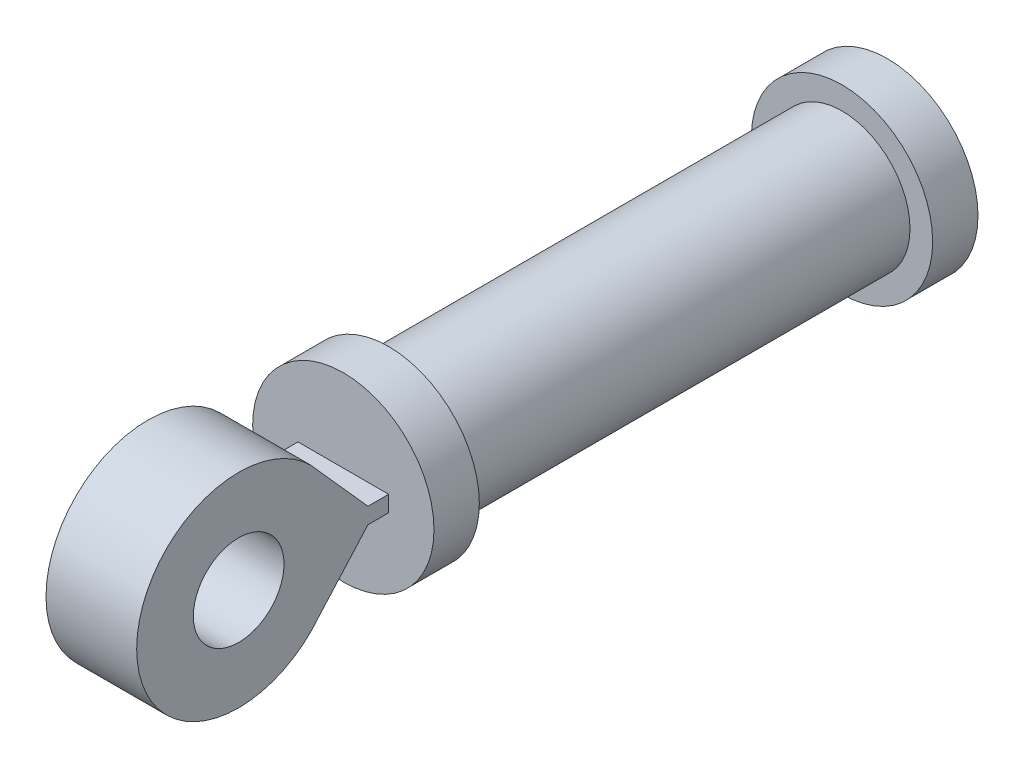
ISO-10303-21;
HEADER;
FILE_DESCRIPTION(('STEP AP214'),'2;1');
FILE_NAME('part.step','',(''),(''),'','','');
FILE_SCHEMA(('AUTOMOTIVE_DESIGN { 1 0 10303 214 1 1 1 1 }'));
ENDSEC;
DATA;
#1=APPLICATION_CONTEXT('core data for automotive mechanical design processes');
#2=APPLICATION_PROTOCOL_DEFINITION('international standard','automotive_design',2000,#1);
#3=PRODUCT_CONTEXT('',#1,'mechanical');
#4=PRODUCT('Part','Part','',(#3));
#5=PRODUCT_RELATED_PRODUCT_CATEGORY('part','',(#4));
#6=PRODUCT_DEFINITION_FORMATION('','',#4);
#7=PRODUCT_DEFINITION_CONTEXT('part definition',#1,'design');
#8=PRODUCT_DEFINITION('design','',#6,#7);
#9=PRODUCT_DEFINITION_SHAPE('','',#8);
#10=(LENGTH_UNIT() NAMED_UNIT(*) SI_UNIT(.MILLI.,.METRE.));
#11=(NAMED_UNIT(*) PLANE_ANGLE_UNIT() SI_UNIT($,.RADIAN.));
#12=(NAMED_UNIT(*) SI_UNIT($,.STERADIAN.) SOLID_ANGLE_UNIT());
#13=UNCERTAINTY_MEASURE_WITH_UNIT(LENGTH_MEASURE(1.E-05),#10,'distance_accuracy_value','');
#14=(GEOMETRIC_REPRESENTATION_CONTEXT(3) GLOBAL_UNCERTAINTY_ASSIGNED_CONTEXT((#13)) GLOBAL_UNIT_ASSIGNED_CONTEXT((#10,
#11,#12)) REPRESENTATION_CONTEXT('',''));
#15=CARTESIAN_POINT('',(0.,0.,0.));
#16=DIRECTION('',(0.,0.,1.));
#17=DIRECTION('',(1.,0.,0.));
#18=AXIS2_PLACEMENT_3D('',#15,#16,#17);
#19=CARTESIAN_POINT('',(0.,0.,-83.9277892779569));
#20=DIRECTION('',(0.,0.,-1.));
#21=DIRECTION('',(-1.,0.,0.));
#22=AXIS2_PLACEMENT_3D('',#19,#20,#21);
#23=CYLINDRICAL_SURFACE('',#22,20.);
#24=CARTESIAN_POINT('',(0.,0.,-83.9277892779569));
#25=DIRECTION('',(0.,0.,1.));
#26=DIRECTION('',(1.,0.,0.));
#27=AXIS2_PLACEMENT_3D('',#24,#25,#26);
#28=CIRCLE('',#27,20.);
#29=CARTESIAN_POINT('',(20.,0.,-83.9277892779569));
#30=VERTEX_POINT('',#29);
#31=EDGE_CURVE('E78',#30,#30,#28,.T.);
#32=ORIENTED_EDGE('',*,*,#31,.F.);
#33=EDGE_LOOP('',(#32));
#34=FACE_BOUND('',#33,.T.);
#35=CARTESIAN_POINT('',(0.,0.,-93.9277892779569));
#36=DIRECTION('',(0.,0.,1.));
#37=DIRECTION('',(1.,0.,0.));
#38=AXIS2_PLACEMENT_3D('',#35,#36,#37);
#39=CIRCLE('',#38,20.);
#40=CARTESIAN_POINT('',(20.,0.,-93.9277892779569));
#41=VERTEX_POINT('',#40);
#42=EDGE_CURVE('E190',#41,#41,#39,.T.);
#43=ORIENTED_EDGE('',*,*,#42,.T.);
#44=EDGE_LOOP('',(#43));
#45=FACE_BOUND('',#44,.T.);
#46=ADVANCED_FACE('F70',(#34,#45),#23,.T.);
#47=CARTESIAN_POINT('',(0.,0.,-83.9277892779569));
#48=DIRECTION('',(0.,0.,1.));
#49=DIRECTION('',(1.,0.,0.));
#50=AXIS2_PLACEMENT_3D('',#47,#48,#49);
#51=PLANE('',#50);
#52=CARTESIAN_POINT('',(0.,0.,-83.9277892779569));
#53=DIRECTION('',(0.,0.,1.));
#54=DIRECTION('',(1.,0.,0.));
#55=AXIS2_PLACEMENT_3D('',#52,#53,#54);
#56=CIRCLE('',#55,15.);
#57=CARTESIAN_POINT('',(15.,0.,-83.9277892779569));
#58=VERTEX_POINT('',#57);
#59=EDGE_CURVE('E12',#58,#58,#56,.T.);
#60=ORIENTED_EDGE('',*,*,#59,.F.);
#61=EDGE_LOOP('',(#60));
#62=FACE_BOUND('',#61,.T.);
#63=ORIENTED_EDGE('',*,*,#31,.T.);
#64=EDGE_LOOP('',(#63));
#65=FACE_BOUND('',#64,.T.);
#66=ADVANCED_FACE('F240',(#62,#65),#51,.T.);
#67=CARTESIAN_POINT('',(0.,0.,-93.9277892779569));
#68=DIRECTION('',(0.,0.,1.));
#69=DIRECTION('',(1.,0.,0.));
#70=AXIS2_PLACEMENT_3D('',#67,#68,#69);
#71=PLANE('',#70);
#72=CARTESIAN_POINT('',(0.,0.,-93.9277892779569));
#73=DIRECTION('',(0.,0.,1.));
#74=DIRECTION('',(1.,0.,0.));
#75=AXIS2_PLACEMENT_3D('',#72,#73,#74);
#76=CIRCLE('',#75,4.8);
#77=CARTESIAN_POINT('',(4.8,0.,-93.9277892779569));
#78=VERTEX_POINT('',#77);
#79=EDGE_CURVE('E187',#78,#78,#76,.T.);
#80=ORIENTED_EDGE('',*,*,#79,.T.);
#81=EDGE_LOOP('',(#80));
#82=FACE_BOUND('',#81,.T.);
#83=ORIENTED_EDGE('',*,*,#42,.F.);
#84=EDGE_LOOP('',(#83));
#85=FACE_BOUND('',#84,.T.);
#86=ADVANCED_FACE('F245',(#82,#85),#71,.F.);
#87=CARTESIAN_POINT('',(0.,0.,-83.9277892779569));
#88=DIRECTION('',(0.,0.,1.));
#89=DIRECTION('',(1.,0.,0.));
#90=AXIS2_PLACEMENT_3D('',#87,#88,#89);
#91=CYLINDRICAL_SURFACE('',#90,4.8);
#92=CARTESIAN_POINT('',(0.,0.,-89.1277892779569));
#93=DIRECTION('',(0.,0.,1.));
#94=DIRECTION('',(1.,0.,0.));
#95=AXIS2_PLACEMENT_3D('',#92,#93,#94);
#96=CIRCLE('',#95,4.8);
#97=CARTESIAN_POINT('',(4.8,0.,-89.1277892779569));
#98=VERTEX_POINT('',#97);
#99=EDGE_CURVE('E184',#98,#98,#96,.T.);
#100=ORIENTED_EDGE('',*,*,#99,.T.);
#101=EDGE_LOOP('',(#100));
#102=FACE_BOUND('',#101,.T.);
#103=ORIENTED_EDGE('',*,*,#79,.F.);
#104=EDGE_LOOP('',(#103));
#105=FACE_BOUND('',#104,.T.);
#106=ADVANCED_FACE('F253',(#102,#105),#91,.F.);
#107=CARTESIAN_POINT('',(4.8,0.,-89.1277892779569));
#108=DIRECTION('',(0.,0.,-1.));
#109=DIRECTION('',(-1.,0.,0.));
#110=AXIS2_PLACEMENT_3D('',#107,#108,#109);
#111=PLANE('',#110);
#112=ORIENTED_EDGE('',*,*,#99,.F.);
#113=EDGE_LOOP('',(#112));
#114=FACE_BOUND('',#113,.T.);
#115=CARTESIAN_POINT('',(0.,0.,-89.1277892779569));
#116=DIRECTION('',(0.,0.,1.));
#117=DIRECTION('',(1.,0.,0.));
#118=AXIS2_PLACEMENT_3D('',#115,#116,#117);
#119=CIRCLE('',#118,8.);
#120=CARTESIAN_POINT('',(8.,0.,-89.1277892779569));
#121=VERTEX_POINT('',#120);
#122=EDGE_CURVE('E181',#121,#121,#119,.T.);
#123=ORIENTED_EDGE('',*,*,#122,.T.);
#124=EDGE_LOOP('',(#123));
#125=FACE_BOUND('',#124,.T.);
#126=ADVANCED_FACE('F258',(#114,#125),#111,.F.);
#127=CARTESIAN_POINT('',(0.,0.,-83.9277892779569));
#128=DIRECTION('',(0.,0.,1.));
#129=DIRECTION('',(1.,0.,0.));
#130=AXIS2_PLACEMENT_3D('',#127,#128,#129);
#131=CYLINDRICAL_SURFACE('',#130,8.);
#132=ORIENTED_EDGE('',*,*,#122,.F.);
#133=EDGE_LOOP('',(#132));
#134=FACE_BOUND('',#133,.T.);
#135=CARTESIAN_POINT('',(0.,0.,-83.9777892779569));
#136=DIRECTION('',(0.,0.,1.));
#137=DIRECTION('',(1.,0.,0.));
#138=AXIS2_PLACEMENT_3D('',#135,#136,#137);
#139=CIRCLE('',#138,8.00000000000001);
#140=CARTESIAN_POINT('',(8.00000000000001,0.,-83.9777892779569));
#141=VERTEX_POINT('',#140);
#142=EDGE_CURVE('E178',#141,#141,#139,.T.);
#143=ORIENTED_EDGE('',*,*,#142,.T.);
#144=EDGE_LOOP('',(#143));
#145=FACE_BOUND('',#144,.T.);
#146=ADVANCED_FACE('F264',(#134,#145),#131,.F.);
#147=CARTESIAN_POINT('',(0.,0.,-83.9277892779569));
#148=DIRECTION('',(0.,0.,1.));
#149=DIRECTION('',(1.,0.,0.));
#150=AXIS2_PLACEMENT_3D('',#147,#148,#149);
#151=CONICAL_SURFACE('',#150,8.05,0.785398163397448);
#152=ORIENTED_EDGE('',*,*,#142,.F.);
#153=EDGE_LOOP('',(#152));
#154=FACE_BOUND('',#153,.T.);
#155=CARTESIAN_POINT('',(0.,0.,-83.9277892779569));
#156=DIRECTION('',(0.,0.,1.));
#157=DIRECTION('',(1.,0.,0.));
#158=AXIS2_PLACEMENT_3D('',#155,#156,#157);
#159=CIRCLE('',#158,8.05);
#160=CARTESIAN_POINT('',(8.05,0.,-83.9277892779569));
#161=VERTEX_POINT('',#160);
#162=EDGE_CURVE('E174',#161,#161,#159,.T.);
#163=ORIENTED_EDGE('',*,*,#162,.T.);
#164=EDGE_LOOP('',(#163));
#165=FACE_BOUND('',#164,.T.);
#166=ADVANCED_FACE('F268',(#154,#165),#151,.F.);
#167=CARTESIAN_POINT('',(0.,0.,16.0722107220431));
#168=DIRECTION('',(0.,0.,-1.));
#169=DIRECTION('',(-1.,0.,0.));
#170=AXIS2_PLACEMENT_3D('',#167,#168,#169);
#171=CYLINDRICAL_SURFACE('',#170,15.);
#172=CARTESIAN_POINT('',(0.,0.,16.0722107220431));
#173=DIRECTION('',(0.,0.,1.));
#174=DIRECTION('',(1.,0.,0.));
#175=AXIS2_PLACEMENT_3D('',#172,#173,#174);
#176=CIRCLE('',#175,15.);
#177=CARTESIAN_POINT('',(15.,0.,16.0722107220431));
#178=VERTEX_POINT('',#177);
#179=EDGE_CURVE('E170',#178,#178,#176,.T.);
#180=ORIENTED_EDGE('',*,*,#179,.F.);
#181=EDGE_LOOP('',(#180));
#182=FACE_BOUND('',#181,.T.);
#183=ORIENTED_EDGE('',*,*,#59,.T.);
#184=EDGE_LOOP('',(#183));
#185=FACE_BOUND('',#184,.T.);
#186=ADVANCED_FACE('F272',(#182,#185),#171,.T.);
#187=CARTESIAN_POINT('',(0.,0.,-83.9277892779569));
#188=DIRECTION('',(0.,0.,1.));
#189=DIRECTION('',(1.,0.,0.));
#190=AXIS2_PLACEMENT_3D('',#187,#188,#189);
#191=PLANE('',#190);
#192=CARTESIAN_POINT('',(0.,0.,-83.9277892779569));
#193=DIRECTION('',(0.,0.,1.));
#194=DIRECTION('',(1.,0.,0.));
#195=AXIS2_PLACEMENT_3D('',#192,#193,#194);
#196=CIRCLE('',#195,8.);
#197=CARTESIAN_POINT('',(8.,0.,-83.9277892779569));
#198=VERTEX_POINT('',#197);
#199=EDGE_CURVE('E167',#198,#198,#196,.T.);
#200=ORIENTED_EDGE('',*,*,#199,.T.);
#201=EDGE_LOOP('',(#200));
#202=FACE_BOUND('',#201,.T.);
#203=ORIENTED_EDGE('',*,*,#162,.F.);
#204=EDGE_LOOP('',(#203));
#205=FACE_BOUND('',#204,.T.);
#206=ADVANCED_FACE('F276',(#202,#205),#191,.F.);
#207=CARTESIAN_POINT('',(0.,0.,-83.9277892779569));
#208=DIRECTION('',(0.,0.,1.));
#209=DIRECTION('',(1.,0.,0.));
#210=AXIS2_PLACEMENT_3D('',#207,#208,#209);
#211=CYLINDRICAL_SURFACE('',#210,8.);
#212=ORIENTED_EDGE('',*,*,#199,.F.);
#213=EDGE_LOOP('',(#212));
#214=FACE_BOUND('',#213,.T.);
#215=CARTESIAN_POINT('',(0.,0.,16.0722107220431));
#216=DIRECTION('',(0.,0.,1.));
#217=DIRECTION('',(1.,0.,0.));
#218=AXIS2_PLACEMENT_3D('',#215,#216,#217);
#219=CIRCLE('',#218,8.);
#220=CARTESIAN_POINT('',(8.,0.,16.0722107220431));
#221=VERTEX_POINT('',#220);
#222=EDGE_CURVE('E163',#221,#221,#219,.T.);
#223=ORIENTED_EDGE('',*,*,#222,.T.);
#224=EDGE_LOOP('',(#223));
#225=FACE_BOUND('',#224,.T.);
#226=ADVANCED_FACE('F280',(#214,#225),#211,.F.);
#227=CARTESIAN_POINT('',(0.,0.,16.0722107220431));
#228=DIRECTION('',(0.,0.,1.));
#229=DIRECTION('',(1.,0.,0.));
#230=AXIS2_PLACEMENT_3D('',#227,#228,#229);
#231=PLANE('',#230);
#232=ORIENTED_EDGE('',*,*,#179,.T.);
#233=EDGE_LOOP('',(#232));
#234=FACE_BOUND('',#233,.T.);
#235=CARTESIAN_POINT('',(0.,0.,16.0722107220431));
#236=DIRECTION('',(0.,0.,1.));
#237=DIRECTION('',(1.,0.,0.));
#238=AXIS2_PLACEMENT_3D('',#235,#236,#237);
#239=CIRCLE('',#238,20.);
#240=CARTESIAN_POINT('',(20.,0.,16.0722107220431));
#241=VERTEX_POINT('',#240);
#242=EDGE_CURVE('E164',#241,#241,#239,.T.);
#243=ORIENTED_EDGE('',*,*,#242,.F.);
#244=EDGE_LOOP('',(#243));
#245=FACE_BOUND('',#244,.T.);
#246=ADVANCED_FACE('F284',(#234,#245),#231,.F.);
#247=CARTESIAN_POINT('',(0.,0.,26.0722107220431));
#248=DIRECTION('',(0.,0.,-1.));
#249=DIRECTION('',(-1.,0.,0.));
#250=AXIS2_PLACEMENT_3D('',#247,#248,#249);
#251=CYLINDRICAL_SURFACE('',#250,20.);
#252=CARTESIAN_POINT('',(0.,0.,26.0722107220431));
#253=DIRECTION('',(0.,0.,1.));
#254=DIRECTION('',(1.,0.,0.));
#255=AXIS2_PLACEMENT_3D('',#252,#253,#254);
#256=CIRCLE('',#255,20.);
#257=CARTESIAN_POINT('',(20.,0.,26.0722107220431));
#258=VERTEX_POINT('',#257);
#259=EDGE_CURVE('E160',#258,#258,#256,.T.);
#260=ORIENTED_EDGE('',*,*,#259,.F.);
#261=EDGE_LOOP('',(#260));
#262=FACE_BOUND('',#261,.T.);
#263=ORIENTED_EDGE('',*,*,#242,.T.);
#264=EDGE_LOOP('',(#263));
#265=FACE_BOUND('',#264,.T.);
#266=ADVANCED_FACE('F286',(#262,#265),#251,.T.);
#267=ORIENTED_EDGE('',*,*,#222,.F.);
#268=EDGE_LOOP('',(#267));
#269=FACE_BOUND('',#268,.T.);
#270=ADVANCED_FACE('F289',(#269),#231,.F.);
#271=CARTESIAN_POINT('',(-103.138410702895,0.,26.0722107220431));
#272=DIRECTION('',(0.,0.,-1.));
#273=DIRECTION('',(-1.,0.,0.));
#274=AXIS2_PLACEMENT_3D('',#271,#272,#273);
#275=PLANE('',#274);
#276=DIRECTION('',(0.,1.,0.));
#277=VECTOR('',#276,1.);
#278=CARTESIAN_POINT('',(-10.,-38.2333456830037,26.0722107220431));
#279=LINE('',#278,#277);
#280=CARTESIAN_POINT('',(-10.,-1.76665431699625,26.0722107220431));
#281=VERTEX_POINT('',#280);
#282=CARTESIAN_POINT('',(-10.,1.76665431699625,26.0722107220431));
#283=VERTEX_POINT('',#282);
#284=EDGE_CURVE('E142',#281,#283,#279,.T.);
#285=ORIENTED_EDGE('',*,*,#284,.T.);
#286=DIRECTION('',(1.,0.,0.));
#287=VECTOR('',#286,1.);
#288=CARTESIAN_POINT('',(-103.138410702895,1.76665431699625,26.0722107220431));
#289=LINE('',#288,#287);
#290=CARTESIAN_POINT('',(10.,1.76665431699625,26.0722107220431));
#291=VERTEX_POINT('',#290);
#292=EDGE_CURVE('E141',#283,#291,#289,.T.);
#293=ORIENTED_EDGE('',*,*,#292,.T.);
#294=DIRECTION('',(0.,1.,0.));
#295=VECTOR('',#294,1.);
#296=CARTESIAN_POINT('',(10.,-38.2333456830037,26.0722107220431));
#297=LINE('',#296,#295);
#298=CARTESIAN_POINT('',(10.,-1.76665431699625,26.0722107220431));
#299=VERTEX_POINT('',#298);
#300=EDGE_CURVE('E125',#299,#291,#297,.T.);
#301=ORIENTED_EDGE('',*,*,#300,.F.);
#302=DIRECTION('',(1.,0.,0.));
#303=VECTOR('',#302,1.);
#304=CARTESIAN_POINT('',(-103.138410702895,-1.76665431699625,26.0722107220431));
#305=LINE('',#304,#303);
#306=EDGE_CURVE('E139',#281,#299,#305,.T.);
#307=ORIENTED_EDGE('',*,*,#306,.F.);
#308=EDGE_LOOP('',(#285,#293,#301,#307));
#309=FACE_BOUND('',#308,.T.);
#310=ORIENTED_EDGE('',*,*,#259,.T.);
#311=EDGE_LOOP('',(#310));
#312=FACE_BOUND('',#311,.T.);
#313=ADVANCED_FACE('F137',(#309,#312),#275,.F.);
#314=CARTESIAN_POINT('',(-103.138410702895,0.,59.1571581742771));
#315=DIRECTION('',(1.,0.,0.));
#316=DIRECTION('',(0.,0.,-1.));
#317=AXIS2_PLACEMENT_3D('',#314,#315,#316);
#318=CYLINDRICAL_SURFACE('',#317,22.5);
#319=CARTESIAN_POINT('',(-9.99999999999999,0.,59.1571581742771));
#320=DIRECTION('',(1.,0.,0.));
#321=DIRECTION('',(0.,0.,-1.));
#322=AXIS2_PLACEMENT_3D('',#319,#320,#321);
#323=CIRCLE('',#322,22.5);
#324=CARTESIAN_POINT('',(-9.99999999999999,-13.8371118858347,41.4149955479541));
#325=VERTEX_POINT('',#324);
#326=CARTESIAN_POINT('',(-9.99999999999999,13.8371118858347,41.4149955479541));
#327=VERTEX_POINT('',#326);
#328=EDGE_CURVE('E86',#325,#327,#323,.F.);
#329=ORIENTED_EDGE('',*,*,#328,.F.);
#330=DIRECTION('',(1.,0.,0.));
#331=VECTOR('',#330,1.);
#332=CARTESIAN_POINT('',(-103.138410702895,-13.8371118858347,41.4149955479541));
#333=LINE('',#332,#331);
#334=CARTESIAN_POINT('',(9.99999999999999,-13.8371118858347,41.4149955479541));
#335=VERTEX_POINT('',#334);
#336=EDGE_CURVE('E149',#325,#335,#333,.T.);
#337=ORIENTED_EDGE('',*,*,#336,.T.);
#338=CARTESIAN_POINT('',(9.99999999999999,0.,59.1571581742771));
#339=DIRECTION('',(-1.,0.,0.));
#340=DIRECTION('',(0.,0.,1.));
#341=AXIS2_PLACEMENT_3D('',#338,#339,#340);
#342=CIRCLE('',#341,22.5);
#343=CARTESIAN_POINT('',(9.99999999999999,13.8371118858347,41.4149955479541));
#344=VERTEX_POINT('',#343);
#345=EDGE_CURVE('E203',#344,#335,#342,.F.);
#346=ORIENTED_EDGE('',*,*,#345,.F.);
#347=DIRECTION('',(1.,0.,0.));
#348=VECTOR('',#347,1.);
#349=CARTESIAN_POINT('',(-103.138410702895,13.8371118858347,41.4149955479541));
#350=LINE('',#349,#348);
#351=EDGE_CURVE('E157',#327,#344,#350,.T.);
#352=ORIENTED_EDGE('',*,*,#351,.F.);
#353=EDGE_LOOP('',(#329,#337,#346,#352));
#354=FACE_BOUND('',#353,.T.);
#355=ADVANCED_FACE('F218',(#354),#318,.T.);
#356=CARTESIAN_POINT('',(-103.138410702895,14.435755370971,16.162140944851));
#357=DIRECTION('',(0.,0.666151135501625,0.745816776876127));
#358=DIRECTION('',(0.,-0.745816776876127,0.666151135501626));
#359=AXIS2_PLACEMENT_3D('',#356,#357,#358);
#360=PLANE('',#359);
#361=ORIENTED_EDGE('',*,*,#336,.F.);
#362=DIRECTION('',(0.,0.745816776876127,-0.666151135501626));
#363=VECTOR('',#362,1.);
#364=CARTESIAN_POINT('',(-9.99999999999999,14.435755370971,16.162140944851));
#365=LINE('',#364,#363);
#366=CARTESIAN_POINT('',(-9.99999999999999,-1.76665431699625,30.633863687144));
#367=VERTEX_POINT('',#366);
#368=EDGE_CURVE('E211',#325,#367,#365,.T.);
#369=ORIENTED_EDGE('',*,*,#368,.T.);
#370=DIRECTION('',(1.,0.,0.));
#371=VECTOR('',#370,1.);
#372=CARTESIAN_POINT('',(-103.138410702895,-1.76665431699625,30.633863687144));
#373=LINE('',#372,#371);
#374=CARTESIAN_POINT('',(9.99999999999999,-1.76665431699625,30.633863687144));
#375=VERTEX_POINT('',#374);
#376=EDGE_CURVE('E147',#367,#375,#373,.T.);
#377=ORIENTED_EDGE('',*,*,#376,.T.);
#378=DIRECTION('',(0.,-0.745816776876127,0.666151135501626));
#379=VECTOR('',#378,1.);
#380=CARTESIAN_POINT('',(9.99999999999999,14.435755370971,16.162140944851));
#381=LINE('',#380,#379);
#382=EDGE_CURVE('E127',#375,#335,#381,.T.);
#383=ORIENTED_EDGE('',*,*,#382,.T.);
#384=EDGE_LOOP('',(#361,#369,#377,#383));
#385=FACE_BOUND('',#384,.T.);
#386=ADVANCED_FACE('F221',(#385),#360,.F.);
#387=CARTESIAN_POINT('',(-103.138410702895,-1.76665431699628,0.));
#388=DIRECTION('',(0.,1.,0.));
#389=DIRECTION('',(0.,0.,1.));
#390=AXIS2_PLACEMENT_3D('',#387,#388,#389);
#391=PLANE('',#390);
#392=ORIENTED_EDGE('',*,*,#376,.F.);
#393=DIRECTION('',(0.,0.,-1.));
#394=VECTOR('',#393,1.);
#395=CARTESIAN_POINT('',(-9.99999999999999,-1.76665431699628,0.));
#396=LINE('',#395,#394);
#397=EDGE_CURVE('E146',#367,#281,#396,.T.);
#398=ORIENTED_EDGE('',*,*,#397,.T.);
#399=ORIENTED_EDGE('',*,*,#306,.T.);
#400=DIRECTION('',(0.,0.,1.));
#401=VECTOR('',#400,1.);
#402=CARTESIAN_POINT('',(9.99999999999999,-1.76665431699628,0.));
#403=LINE('',#402,#401);
#404=EDGE_CURVE('E122',#299,#375,#403,.T.);
#405=ORIENTED_EDGE('',*,*,#404,.T.);
#406=EDGE_LOOP('',(#392,#398,#399,#405));
#407=FACE_BOUND('',#406,.T.);
#408=ADVANCED_FACE('F145',(#407),#391,.F.);
#409=CARTESIAN_POINT('',(-103.138410702895,1.76665431699626,0.));
#410=DIRECTION('',(0.,1.,0.));
#411=DIRECTION('',(0.,0.,1.));
#412=AXIS2_PLACEMENT_3D('',#409,#410,#411);
#413=PLANE('',#412);
#414=DIRECTION('',(0.,0.,-1.));
#415=VECTOR('',#414,1.);
#416=CARTESIAN_POINT('',(-9.99999999999999,1.76665431699626,0.));
#417=LINE('',#416,#415);
#418=CARTESIAN_POINT('',(-9.99999999999999,1.76665431699625,30.633863687144));
#419=VERTEX_POINT('',#418);
#420=EDGE_CURVE('E208',#419,#283,#417,.T.);
#421=ORIENTED_EDGE('',*,*,#420,.F.);
#422=DIRECTION('',(1.,0.,0.));
#423=VECTOR('',#422,1.);
#424=CARTESIAN_POINT('',(-103.138410702895,1.76665431699625,30.633863687144));
#425=LINE('',#424,#423);
#426=CARTESIAN_POINT('',(9.99999999999999,1.76665431699625,30.633863687144));
#427=VERTEX_POINT('',#426);
#428=EDGE_CURVE('E151',#419,#427,#425,.T.);
#429=ORIENTED_EDGE('',*,*,#428,.T.);
#430=DIRECTION('',(0.,0.,1.));
#431=VECTOR('',#430,1.);
#432=CARTESIAN_POINT('',(9.99999999999999,1.76665431699626,0.));
#433=LINE('',#432,#431);
#434=EDGE_CURVE('E94',#291,#427,#433,.T.);
#435=ORIENTED_EDGE('',*,*,#434,.F.);
#436=ORIENTED_EDGE('',*,*,#292,.F.);
#437=EDGE_LOOP('',(#421,#429,#435,#436));
#438=FACE_BOUND('',#437,.T.);
#439=ADVANCED_FACE('F226',(#438),#413,.T.);
#440=CARTESIAN_POINT('',(-103.138410702895,-14.435755370971,16.162140944851));
#441=DIRECTION('',(0.,0.666151135501625,-0.745816776876127));
#442=DIRECTION('',(0.,0.745816776876127,0.666151135501625));
#443=AXIS2_PLACEMENT_3D('',#440,#441,#442);
#444=PLANE('',#443);
#445=DIRECTION('',(0.,-0.745816776876127,-0.666151135501625));
#446=VECTOR('',#445,1.);
#447=CARTESIAN_POINT('',(-9.99999999999999,-14.435755370971,16.162140944851));
#448=LINE('',#447,#446);
#449=EDGE_CURVE('E206',#327,#419,#448,.T.);
#450=ORIENTED_EDGE('',*,*,#449,.F.);
#451=ORIENTED_EDGE('',*,*,#351,.T.);
#452=DIRECTION('',(0.,0.745816776876127,0.666151135501625));
#453=VECTOR('',#452,1.);
#454=CARTESIAN_POINT('',(9.99999999999999,-14.435755370971,16.162140944851));
#455=LINE('',#454,#453);
#456=EDGE_CURVE('E196',#427,#344,#455,.T.);
#457=ORIENTED_EDGE('',*,*,#456,.F.);
#458=ORIENTED_EDGE('',*,*,#428,.F.);
#459=EDGE_LOOP('',(#450,#451,#457,#458));
#460=FACE_BOUND('',#459,.T.);
#461=ADVANCED_FACE('F228',(#460),#444,.T.);
#462=CARTESIAN_POINT('',(10.,-38.2333456830037,81.6571581742771));
#463=DIRECTION('',(-1.,0.,0.));
#464=DIRECTION('',(0.,0.,1.));
#465=AXIS2_PLACEMENT_3D('',#462,#463,#464);
#466=PLANE('',#465);
#467=CARTESIAN_POINT('',(9.99999999999999,0.,59.1571581742771));
#468=DIRECTION('',(-1.,0.,0.));
#469=DIRECTION('',(0.,0.,1.));
#470=AXIS2_PLACEMENT_3D('',#467,#468,#469);
#471=CIRCLE('',#470,10.);
#472=CARTESIAN_POINT('',(9.99999999999999,0.,69.1571581742771));
#473=VERTEX_POINT('',#472);
#474=EDGE_CURVE('E194',#473,#473,#471,.F.);
#475=ORIENTED_EDGE('',*,*,#474,.F.);
#476=EDGE_LOOP('',(#475));
#477=FACE_BOUND('',#476,.T.);
#478=ORIENTED_EDGE('',*,*,#300,.T.);
#479=ORIENTED_EDGE('',*,*,#434,.T.);
#480=ORIENTED_EDGE('',*,*,#456,.T.);
#481=ORIENTED_EDGE('',*,*,#345,.T.);
#482=ORIENTED_EDGE('',*,*,#382,.F.);
#483=ORIENTED_EDGE('',*,*,#404,.F.);
#484=EDGE_LOOP('',(#478,#479,#480,#481,#482,#483));
#485=FACE_BOUND('',#484,.T.);
#486=ADVANCED_FACE('F124',(#477,#485),#466,.F.);
#487=CARTESIAN_POINT('',(-10.,-38.2333456830037,26.0722107220431));
#488=DIRECTION('',(1.,0.,0.));
#489=DIRECTION('',(0.,0.,-1.));
#490=AXIS2_PLACEMENT_3D('',#487,#488,#489);
#491=PLANE('',#490);
#492=CARTESIAN_POINT('',(-9.99999999999999,0.,59.1571581742771));
#493=DIRECTION('',(1.,0.,0.));
#494=DIRECTION('',(0.,0.,-1.));
#495=AXIS2_PLACEMENT_3D('',#492,#493,#494);
#496=CIRCLE('',#495,10.);
#497=CARTESIAN_POINT('',(-9.99999999999999,0.,49.1571581742771));
#498=VERTEX_POINT('',#497);
#499=EDGE_CURVE('E73',#498,#498,#496,.F.);
#500=ORIENTED_EDGE('',*,*,#499,.F.);
#501=EDGE_LOOP('',(#500));
#502=FACE_BOUND('',#501,.T.);
#503=ORIENTED_EDGE('',*,*,#368,.F.);
#504=ORIENTED_EDGE('',*,*,#328,.T.);
#505=ORIENTED_EDGE('',*,*,#449,.T.);
#506=ORIENTED_EDGE('',*,*,#420,.T.);
#507=ORIENTED_EDGE('',*,*,#284,.F.);
#508=ORIENTED_EDGE('',*,*,#397,.F.);
#509=EDGE_LOOP('',(#503,#504,#505,#506,#507,#508));
#510=FACE_BOUND('',#509,.T.);
#511=ADVANCED_FACE('F222',(#502,#510),#491,.F.);
#512=CARTESIAN_POINT('',(-103.138410702895,0.,59.1571581742771));
#513=DIRECTION('',(1.,0.,0.));
#514=DIRECTION('',(0.,0.,-1.));
#515=AXIS2_PLACEMENT_3D('',#512,#513,#514);
#516=CYLINDRICAL_SURFACE('',#515,10.);
#517=ORIENTED_EDGE('',*,*,#499,.T.);
#518=EDGE_LOOP('',(#517));
#519=FACE_BOUND('',#518,.T.);
#520=ORIENTED_EDGE('',*,*,#474,.T.);
#521=EDGE_LOOP('',(#520));
#522=FACE_BOUND('',#521,.T.);
#523=ADVANCED_FACE('F307',(#519,#522),#516,.F.);
#524=CLOSED_SHELL('',(#46,#66,#86,#106,#126,#146,#166,#186,#206,#226,#246,#266,#270,#313,#355,
#386,#408,#439,#461,#486,#511,#523));
#525=MANIFOLD_SOLID_BREP('B2',#524);
#526=ADVANCED_BREP_SHAPE_REPRESENTATION('',(#18,#525),#14);
#527=SHAPE_DEFINITION_REPRESENTATION(#9,#526);
ENDSEC;
END-ISO-10303-21;
